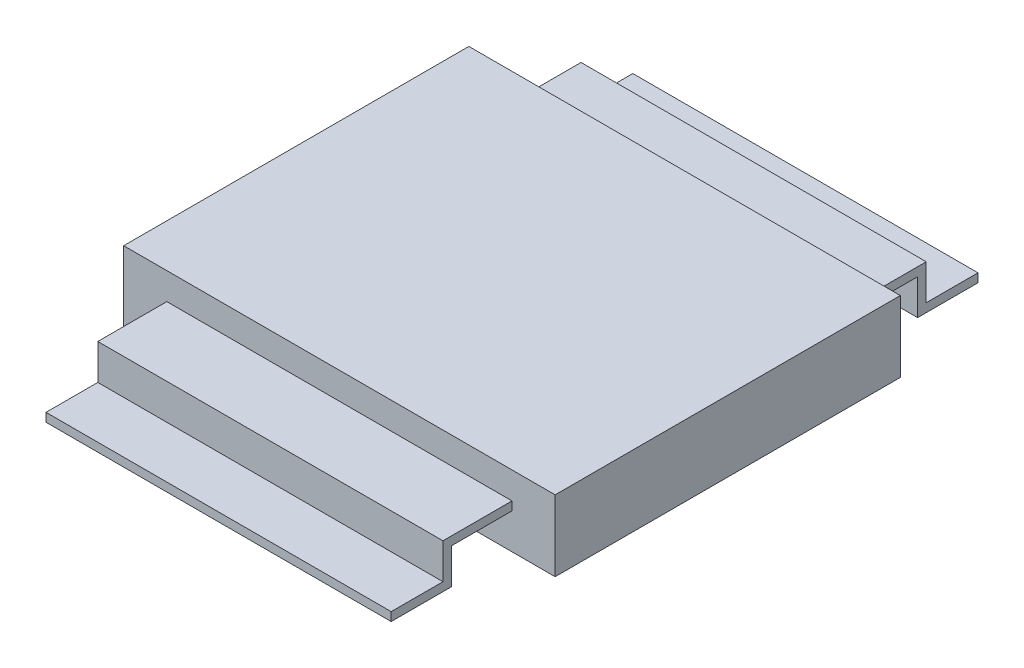
ISO-10303-21;
HEADER;
FILE_DESCRIPTION(('STEP AP214'),'2;1');
FILE_NAME('part.step','',(''),(''),'','','');
FILE_SCHEMA(('AUTOMOTIVE_DESIGN { 1 0 10303 214 1 1 1 1 }'));
ENDSEC;
DATA;
#1=APPLICATION_CONTEXT('core data for automotive mechanical design processes');
#2=APPLICATION_PROTOCOL_DEFINITION('international standard','automotive_design',2000,#1);
#3=PRODUCT_CONTEXT('',#1,'mechanical');
#4=PRODUCT('Part','Part','',(#3));
#5=PRODUCT_RELATED_PRODUCT_CATEGORY('part','',(#4));
#6=PRODUCT_DEFINITION_FORMATION('','',#4);
#7=PRODUCT_DEFINITION_CONTEXT('part definition',#1,'design');
#8=PRODUCT_DEFINITION('design','',#6,#7);
#9=PRODUCT_DEFINITION_SHAPE('','',#8);
#10=(LENGTH_UNIT() NAMED_UNIT(*) SI_UNIT(.MILLI.,.METRE.));
#11=(NAMED_UNIT(*) PLANE_ANGLE_UNIT() SI_UNIT($,.RADIAN.));
#12=(NAMED_UNIT(*) SI_UNIT($,.STERADIAN.) SOLID_ANGLE_UNIT());
#13=UNCERTAINTY_MEASURE_WITH_UNIT(LENGTH_MEASURE(1.E-05),#10,'distance_accuracy_value','');
#14=(GEOMETRIC_REPRESENTATION_CONTEXT(3) GLOBAL_UNCERTAINTY_ASSIGNED_CONTEXT((#13)) GLOBAL_UNIT_ASSIGNED_CONTEXT((#10,
#11,#12)) REPRESENTATION_CONTEXT('',''));
#15=CARTESIAN_POINT('',(0.,0.,0.));
#16=DIRECTION('',(0.,0.,1.));
#17=DIRECTION('',(1.,0.,0.));
#18=AXIS2_PLACEMENT_3D('',#15,#16,#17);
#19=CARTESIAN_POINT('',(3.175,1.044000004,2.54));
#20=DIRECTION('',(0.,0.,-1.));
#21=DIRECTION('',(0.,1.,0.));
#22=AXIS2_PLACEMENT_3D('',#19,#20,#21);
#23=PLANE('',#22);
#24=DIRECTION('',(-1.,0.,0.));
#25=VECTOR('',#24,1.);
#26=CARTESIAN_POINT('',(2.54,0.649000002000003,2.54));
#27=LINE('',#26,#25);
#28=CARTESIAN_POINT('',(2.54,0.649000002000003,2.54));
#29=VERTEX_POINT('',#28);
#30=CARTESIAN_POINT('',(-2.54,0.649000002000003,2.54));
#31=VERTEX_POINT('',#30);
#32=EDGE_CURVE('E284',#29,#31,#27,.T.);
#33=ORIENTED_EDGE('',*,*,#32,.F.);
#34=DIRECTION('',(0.,-1.,0.));
#35=VECTOR('',#34,1.);
#36=CARTESIAN_POINT('',(2.54,0.649000002000003,2.54));
#37=LINE('',#36,#35);
#38=CARTESIAN_POINT('',(2.54,0.522000002000003,2.54));
#39=VERTEX_POINT('',#38);
#40=EDGE_CURVE('E252',#29,#39,#37,.T.);
#41=ORIENTED_EDGE('',*,*,#40,.T.);
#42=DIRECTION('',(-1.,0.,0.));
#43=VECTOR('',#42,1.);
#44=CARTESIAN_POINT('',(2.54,0.522000002000003,2.54));
#45=LINE('',#44,#43);
#46=CARTESIAN_POINT('',(-2.54,0.522000002000003,2.54));
#47=VERTEX_POINT('',#46);
#48=EDGE_CURVE('E287',#39,#47,#45,.T.);
#49=ORIENTED_EDGE('',*,*,#48,.T.);
#50=DIRECTION('',(0.,-1.,0.));
#51=VECTOR('',#50,1.);
#52=CARTESIAN_POINT('',(-2.54,0.649000002000003,2.54));
#53=LINE('',#52,#51);
#54=EDGE_CURVE('E273',#31,#47,#53,.T.);
#55=ORIENTED_EDGE('',*,*,#54,.F.);
#56=EDGE_LOOP('',(#33,#41,#49,#55));
#57=FACE_BOUND('',#56,.T.);
#58=DIRECTION('',(0.,-1.,0.));
#59=VECTOR('',#58,1.);
#60=CARTESIAN_POINT('',(-3.175,1.044000004,2.54));
#61=LINE('',#60,#59);
#62=CARTESIAN_POINT('',(-3.175,1.044000004,2.54));
#63=VERTEX_POINT('',#62);
#64=CARTESIAN_POINT('',(-3.175,0.,2.54));
#65=VERTEX_POINT('',#64);
#66=EDGE_CURVE('E297',#63,#65,#61,.T.);
#67=ORIENTED_EDGE('',*,*,#66,.T.);
#68=DIRECTION('',(-1.,0.,0.));
#69=VECTOR('',#68,1.);
#70=CARTESIAN_POINT('',(3.175,0.,2.54));
#71=LINE('',#70,#69);
#72=CARTESIAN_POINT('',(3.175,0.,2.54));
#73=VERTEX_POINT('',#72);
#74=EDGE_CURVE('E11',#73,#65,#71,.T.);
#75=ORIENTED_EDGE('',*,*,#74,.F.);
#76=DIRECTION('',(0.,-1.,0.));
#77=VECTOR('',#76,1.);
#78=CARTESIAN_POINT('',(3.175,1.044000004,2.54));
#79=LINE('',#78,#77);
#80=CARTESIAN_POINT('',(3.175,1.044000004,2.54));
#81=VERTEX_POINT('',#80);
#82=EDGE_CURVE('E298',#81,#73,#79,.T.);
#83=ORIENTED_EDGE('',*,*,#82,.F.);
#84=DIRECTION('',(-1.,0.,0.));
#85=VECTOR('',#84,1.);
#86=CARTESIAN_POINT('',(3.175,1.044000004,2.54));
#87=LINE('',#86,#85);
#88=EDGE_CURVE('E308',#81,#63,#87,.T.);
#89=ORIENTED_EDGE('',*,*,#88,.T.);
#90=EDGE_LOOP('',(#67,#75,#83,#89));
#91=FACE_BOUND('',#90,.T.);
#92=ADVANCED_FACE('F35',(#57,#91),#23,.F.);
#93=CARTESIAN_POINT('',(3.175,0.,2.54));
#94=DIRECTION('',(0.,1.,0.));
#95=DIRECTION('',(0.,0.,1.));
#96=AXIS2_PLACEMENT_3D('',#93,#94,#95);
#97=PLANE('',#96);
#98=DIRECTION('',(0.,0.,-1.));
#99=VECTOR('',#98,1.);
#100=CARTESIAN_POINT('',(-3.175,0.,2.54));
#101=LINE('',#100,#99);
#102=CARTESIAN_POINT('',(-3.175,0.,-2.54));
#103=VERTEX_POINT('',#102);
#104=EDGE_CURVE('E311',#65,#103,#101,.T.);
#105=ORIENTED_EDGE('',*,*,#104,.T.);
#106=DIRECTION('',(-1.,0.,0.));
#107=VECTOR('',#106,1.);
#108=CARTESIAN_POINT('',(3.175,0.,-2.54));
#109=LINE('',#108,#107);
#110=CARTESIAN_POINT('',(3.175,0.,-2.54));
#111=VERTEX_POINT('',#110);
#112=EDGE_CURVE('E42',#111,#103,#109,.T.);
#113=ORIENTED_EDGE('',*,*,#112,.F.);
#114=DIRECTION('',(0.,0.,-1.));
#115=VECTOR('',#114,1.);
#116=CARTESIAN_POINT('',(3.175,0.,2.54));
#117=LINE('',#116,#115);
#118=EDGE_CURVE('E301',#73,#111,#117,.T.);
#119=ORIENTED_EDGE('',*,*,#118,.F.);
#120=ORIENTED_EDGE('',*,*,#74,.T.);
#121=EDGE_LOOP('',(#105,#113,#119,#120));
#122=FACE_BOUND('',#121,.T.);
#123=ADVANCED_FACE('F341',(#122),#97,.F.);
#124=CARTESIAN_POINT('',(3.175,1.044000004,-2.54));
#125=DIRECTION('',(0.,0.,1.));
#126=DIRECTION('',(0.,-1.,0.));
#127=AXIS2_PLACEMENT_3D('',#124,#125,#126);
#128=PLANE('',#127);
#129=DIRECTION('',(-1.,0.,0.));
#130=VECTOR('',#129,1.);
#131=CARTESIAN_POINT('',(2.54,0.522000002000003,-2.54));
#132=LINE('',#131,#130);
#133=CARTESIAN_POINT('',(2.54,0.522000002000003,-2.54));
#134=VERTEX_POINT('',#133);
#135=CARTESIAN_POINT('',(-2.54,0.522000002000003,-2.54));
#136=VERTEX_POINT('',#135);
#137=EDGE_CURVE('E54',#134,#136,#132,.T.);
#138=ORIENTED_EDGE('',*,*,#137,.F.);
#139=DIRECTION('',(0.,-1.,0.));
#140=VECTOR('',#139,1.);
#141=CARTESIAN_POINT('',(2.54,0.649000002000003,-2.54));
#142=LINE('',#141,#140);
#143=CARTESIAN_POINT('',(2.54,0.649000002000003,-2.54));
#144=VERTEX_POINT('',#143);
#145=EDGE_CURVE('E49',#144,#134,#142,.T.);
#146=ORIENTED_EDGE('',*,*,#145,.F.);
#147=DIRECTION('',(-1.,0.,0.));
#148=VECTOR('',#147,1.);
#149=CARTESIAN_POINT('',(2.54,0.649000002000003,-2.54));
#150=LINE('',#149,#148);
#151=CARTESIAN_POINT('',(-2.54,0.649000002000003,-2.54));
#152=VERTEX_POINT('',#151);
#153=EDGE_CURVE('E234',#144,#152,#150,.T.);
#154=ORIENTED_EDGE('',*,*,#153,.T.);
#155=DIRECTION('',(0.,-1.,0.));
#156=VECTOR('',#155,1.);
#157=CARTESIAN_POINT('',(-2.54,0.649000002000003,-2.54));
#158=LINE('',#157,#156);
#159=EDGE_CURVE('E213',#152,#136,#158,.T.);
#160=ORIENTED_EDGE('',*,*,#159,.T.);
#161=EDGE_LOOP('',(#138,#146,#154,#160));
#162=FACE_BOUND('',#161,.T.);
#163=DIRECTION('',(0.,1.,0.));
#164=VECTOR('',#163,1.);
#165=CARTESIAN_POINT('',(-3.175,1.044000004,-2.54));
#166=LINE('',#165,#164);
#167=CARTESIAN_POINT('',(-3.175,1.044000004,-2.54));
#168=VERTEX_POINT('',#167);
#169=EDGE_CURVE('E313',#103,#168,#166,.T.);
#170=ORIENTED_EDGE('',*,*,#169,.T.);
#171=DIRECTION('',(-1.,0.,0.));
#172=VECTOR('',#171,1.);
#173=CARTESIAN_POINT('',(3.175,1.044000004,-2.54));
#174=LINE('',#173,#172);
#175=CARTESIAN_POINT('',(3.175,1.044000004,-2.54));
#176=VERTEX_POINT('',#175);
#177=EDGE_CURVE('E318',#176,#168,#174,.T.);
#178=ORIENTED_EDGE('',*,*,#177,.F.);
#179=DIRECTION('',(0.,1.,0.));
#180=VECTOR('',#179,1.);
#181=CARTESIAN_POINT('',(3.175,1.044000004,-2.54));
#182=LINE('',#181,#180);
#183=EDGE_CURVE('E304',#111,#176,#182,.T.);
#184=ORIENTED_EDGE('',*,*,#183,.F.);
#185=ORIENTED_EDGE('',*,*,#112,.T.);
#186=EDGE_LOOP('',(#170,#178,#184,#185));
#187=FACE_BOUND('',#186,.T.);
#188=ADVANCED_FACE('F325',(#162,#187),#128,.F.);
#189=CARTESIAN_POINT('',(3.175,1.044000004,2.54));
#190=DIRECTION('',(0.,-1.,0.));
#191=DIRECTION('',(0.,0.,-1.));
#192=AXIS2_PLACEMENT_3D('',#189,#190,#191);
#193=PLANE('',#192);
#194=DIRECTION('',(0.,0.,1.));
#195=VECTOR('',#194,1.);
#196=CARTESIAN_POINT('',(-3.175,1.044000004,2.54));
#197=LINE('',#196,#195);
#198=EDGE_CURVE('E302',#168,#63,#197,.T.);
#199=ORIENTED_EDGE('',*,*,#198,.T.);
#200=ORIENTED_EDGE('',*,*,#88,.F.);
#201=DIRECTION('',(0.,0.,1.));
#202=VECTOR('',#201,1.);
#203=CARTESIAN_POINT('',(3.175,1.044000004,2.54));
#204=LINE('',#203,#202);
#205=EDGE_CURVE('E306',#176,#81,#204,.T.);
#206=ORIENTED_EDGE('',*,*,#205,.F.);
#207=ORIENTED_EDGE('',*,*,#177,.T.);
#208=EDGE_LOOP('',(#199,#200,#206,#207));
#209=FACE_BOUND('',#208,.T.);
#210=ADVANCED_FACE('F334',(#209),#193,.F.);
#211=CARTESIAN_POINT('',(3.175,0.,0.));
#212=DIRECTION('',(1.,0.,0.));
#213=DIRECTION('',(0.,0.,-1.));
#214=AXIS2_PLACEMENT_3D('',#211,#212,#213);
#215=PLANE('',#214);
#216=ORIENTED_EDGE('',*,*,#82,.T.);
#217=ORIENTED_EDGE('',*,*,#118,.T.);
#218=ORIENTED_EDGE('',*,*,#183,.T.);
#219=ORIENTED_EDGE('',*,*,#205,.T.);
#220=EDGE_LOOP('',(#216,#217,#218,#219));
#221=FACE_BOUND('',#220,.T.);
#222=ADVANCED_FACE('F340',(#221),#215,.T.);
#223=CARTESIAN_POINT('',(-3.175,0.,0.));
#224=DIRECTION('',(1.,0.,0.));
#225=DIRECTION('',(0.,0.,-1.));
#226=AXIS2_PLACEMENT_3D('',#223,#224,#225);
#227=PLANE('',#226);
#228=ORIENTED_EDGE('',*,*,#66,.F.);
#229=ORIENTED_EDGE('',*,*,#198,.F.);
#230=ORIENTED_EDGE('',*,*,#169,.F.);
#231=ORIENTED_EDGE('',*,*,#104,.F.);
#232=EDGE_LOOP('',(#228,#229,#230,#231));
#233=FACE_BOUND('',#232,.T.);
#234=ADVANCED_FACE('F331',(#233),#227,.F.);
#235=CARTESIAN_POINT('',(2.54,0.127,3.429));
#236=DIRECTION('',(0.,-1.,0.));
#237=DIRECTION('',(0.,0.,-1.));
#238=AXIS2_PLACEMENT_3D('',#235,#236,#237);
#239=PLANE('',#238);
#240=DIRECTION('',(0.,0.,-1.));
#241=VECTOR('',#240,1.);
#242=CARTESIAN_POINT('',(-2.54,0.127,3.429));
#243=LINE('',#242,#241);
#244=CARTESIAN_POINT('',(-2.54,0.127,3.556));
#245=VERTEX_POINT('',#244);
#246=CARTESIAN_POINT('',(-2.54,0.127,4.318));
#247=VERTEX_POINT('',#246);
#248=EDGE_CURVE('E179',#245,#247,#243,.F.);
#249=ORIENTED_EDGE('',*,*,#248,.T.);
#250=DIRECTION('',(-1.,0.,0.));
#251=VECTOR('',#250,1.);
#252=CARTESIAN_POINT('',(2.54,0.127,4.318));
#253=LINE('',#252,#251);
#254=CARTESIAN_POINT('',(2.54,0.127,4.318));
#255=VERTEX_POINT('',#254);
#256=EDGE_CURVE('E295',#255,#247,#253,.T.);
#257=ORIENTED_EDGE('',*,*,#256,.F.);
#258=DIRECTION('',(0.,0.,-1.));
#259=VECTOR('',#258,1.);
#260=CARTESIAN_POINT('',(2.54,0.127,3.429));
#261=LINE('',#260,#259);
#262=CARTESIAN_POINT('',(2.54,0.127,3.556));
#263=VERTEX_POINT('',#262);
#264=EDGE_CURVE('E237',#263,#255,#261,.F.);
#265=ORIENTED_EDGE('',*,*,#264,.F.);
#266=DIRECTION('',(-1.,0.,0.));
#267=VECTOR('',#266,1.);
#268=CARTESIAN_POINT('',(2.54,0.127,3.556));
#269=LINE('',#268,#267);
#270=EDGE_CURVE('E258',#263,#245,#269,.T.);
#271=ORIENTED_EDGE('',*,*,#270,.T.);
#272=EDGE_LOOP('',(#249,#257,#265,#271));
#273=FACE_BOUND('',#272,.T.);
#274=ADVANCED_FACE('F354',(#273),#239,.F.);
#275=CARTESIAN_POINT('',(2.54,0.,4.318));
#276=DIRECTION('',(0.,0.,1.));
#277=DIRECTION('',(1.,0.,0.));
#278=AXIS2_PLACEMENT_3D('',#275,#276,#277);
#279=PLANE('',#278);
#280=DIRECTION('',(0.,1.,0.));
#281=VECTOR('',#280,1.);
#282=CARTESIAN_POINT('',(-2.54,0.,4.318));
#283=LINE('',#282,#281);
#284=CARTESIAN_POINT('',(-2.54,0.,4.318));
#285=VERTEX_POINT('',#284);
#286=EDGE_CURVE('E261',#285,#247,#283,.T.);
#287=ORIENTED_EDGE('',*,*,#286,.F.);
#288=DIRECTION('',(-1.,0.,0.));
#289=VECTOR('',#288,1.);
#290=CARTESIAN_POINT('',(2.54,0.,4.318));
#291=LINE('',#290,#289);
#292=CARTESIAN_POINT('',(2.54,0.,4.318));
#293=VERTEX_POINT('',#292);
#294=EDGE_CURVE('E293',#293,#285,#291,.T.);
#295=ORIENTED_EDGE('',*,*,#294,.F.);
#296=DIRECTION('',(0.,1.,0.));
#297=VECTOR('',#296,1.);
#298=CARTESIAN_POINT('',(2.54,0.,4.318));
#299=LINE('',#298,#297);
#300=EDGE_CURVE('E239',#293,#255,#299,.T.);
#301=ORIENTED_EDGE('',*,*,#300,.T.);
#302=ORIENTED_EDGE('',*,*,#256,.T.);
#303=EDGE_LOOP('',(#287,#295,#301,#302));
#304=FACE_BOUND('',#303,.T.);
#305=ADVANCED_FACE('F359',(#304),#279,.T.);
#306=CARTESIAN_POINT('',(2.54,0.,3.429));
#307=DIRECTION('',(0.,-1.,0.));
#308=DIRECTION('',(0.,0.,-1.));
#309=AXIS2_PLACEMENT_3D('',#306,#307,#308);
#310=PLANE('',#309);
#311=DIRECTION('',(0.,0.,1.));
#312=VECTOR('',#311,1.);
#313=CARTESIAN_POINT('',(-2.54,0.,3.429));
#314=LINE('',#313,#312);
#315=CARTESIAN_POINT('',(-2.54,0.,3.429));
#316=VERTEX_POINT('',#315);
#317=EDGE_CURVE('E264',#316,#285,#314,.T.);
#318=ORIENTED_EDGE('',*,*,#317,.F.);
#319=DIRECTION('',(-1.,0.,0.));
#320=VECTOR('',#319,1.);
#321=CARTESIAN_POINT('',(2.54,0.,3.429));
#322=LINE('',#321,#320);
#323=CARTESIAN_POINT('',(2.54,0.,3.429));
#324=VERTEX_POINT('',#323);
#325=EDGE_CURVE('E291',#324,#316,#322,.T.);
#326=ORIENTED_EDGE('',*,*,#325,.F.);
#327=DIRECTION('',(0.,0.,1.));
#328=VECTOR('',#327,1.);
#329=CARTESIAN_POINT('',(2.54,0.,3.429));
#330=LINE('',#329,#328);
#331=EDGE_CURVE('E243',#324,#293,#330,.T.);
#332=ORIENTED_EDGE('',*,*,#331,.T.);
#333=ORIENTED_EDGE('',*,*,#294,.T.);
#334=EDGE_LOOP('',(#318,#326,#332,#333));
#335=FACE_BOUND('',#334,.T.);
#336=ADVANCED_FACE('F363',(#335),#310,.T.);
#337=CARTESIAN_POINT('',(2.54,0.522000002000003,3.429));
#338=DIRECTION('',(0.,0.,-1.));
#339=DIRECTION('',(-1.,0.,0.));
#340=AXIS2_PLACEMENT_3D('',#337,#338,#339);
#341=PLANE('',#340);
#342=DIRECTION('',(0.,-1.,0.));
#343=VECTOR('',#342,1.);
#344=CARTESIAN_POINT('',(-2.54,0.522000002000003,3.429));
#345=LINE('',#344,#343);
#346=CARTESIAN_POINT('',(-2.54,0.522000002000003,3.429));
#347=VERTEX_POINT('',#346);
#348=EDGE_CURVE('E267',#347,#316,#345,.T.);
#349=ORIENTED_EDGE('',*,*,#348,.F.);
#350=DIRECTION('',(-1.,0.,0.));
#351=VECTOR('',#350,1.);
#352=CARTESIAN_POINT('',(2.54,0.522000002000003,3.429));
#353=LINE('',#352,#351);
#354=CARTESIAN_POINT('',(2.54,0.522000002000003,3.429));
#355=VERTEX_POINT('',#354);
#356=EDGE_CURVE('E289',#355,#347,#353,.T.);
#357=ORIENTED_EDGE('',*,*,#356,.F.);
#358=DIRECTION('',(0.,-1.,0.));
#359=VECTOR('',#358,1.);
#360=CARTESIAN_POINT('',(2.54,0.522000002000003,3.429));
#361=LINE('',#360,#359);
#362=EDGE_CURVE('E246',#355,#324,#361,.T.);
#363=ORIENTED_EDGE('',*,*,#362,.T.);
#364=ORIENTED_EDGE('',*,*,#325,.T.);
#365=EDGE_LOOP('',(#349,#357,#363,#364));
#366=FACE_BOUND('',#365,.T.);
#367=ADVANCED_FACE('F367',(#366),#341,.T.);
#368=CARTESIAN_POINT('',(2.54,0.522000002000003,2.54));
#369=DIRECTION('',(0.,-1.,0.));
#370=DIRECTION('',(0.,0.,-1.));
#371=AXIS2_PLACEMENT_3D('',#368,#369,#370);
#372=PLANE('',#371);
#373=DIRECTION('',(0.,0.,1.));
#374=VECTOR('',#373,1.);
#375=CARTESIAN_POINT('',(-2.54,0.522000002000003,2.54));
#376=LINE('',#375,#374);
#377=EDGE_CURVE('E270',#47,#347,#376,.T.);
#378=ORIENTED_EDGE('',*,*,#377,.F.);
#379=ORIENTED_EDGE('',*,*,#48,.F.);
#380=DIRECTION('',(0.,0.,1.));
#381=VECTOR('',#380,1.);
#382=CARTESIAN_POINT('',(2.54,0.522000002000003,2.54));
#383=LINE('',#382,#381);
#384=EDGE_CURVE('E249',#39,#355,#383,.T.);
#385=ORIENTED_EDGE('',*,*,#384,.T.);
#386=ORIENTED_EDGE('',*,*,#356,.T.);
#387=EDGE_LOOP('',(#378,#379,#385,#386));
#388=FACE_BOUND('',#387,.T.);
#389=ADVANCED_FACE('F371',(#388),#372,.T.);
#390=CARTESIAN_POINT('',(2.54,0.649000002000003,2.54));
#391=DIRECTION('',(0.,-1.,0.));
#392=DIRECTION('',(0.,0.,-1.));
#393=AXIS2_PLACEMENT_3D('',#390,#391,#392);
#394=PLANE('',#393);
#395=DIRECTION('',(0.,0.,-1.));
#396=VECTOR('',#395,1.);
#397=CARTESIAN_POINT('',(-2.54,0.649000002000003,2.54));
#398=LINE('',#397,#396);
#399=CARTESIAN_POINT('',(-2.54,0.649000002000003,3.556));
#400=VERTEX_POINT('',#399);
#401=EDGE_CURVE('E276',#31,#400,#398,.F.);
#402=ORIENTED_EDGE('',*,*,#401,.T.);
#403=DIRECTION('',(-1.,0.,0.));
#404=VECTOR('',#403,1.);
#405=CARTESIAN_POINT('',(2.54,0.649000002000003,3.556));
#406=LINE('',#405,#404);
#407=CARTESIAN_POINT('',(2.54,0.649000002000003,3.556));
#408=VERTEX_POINT('',#407);
#409=EDGE_CURVE('E281',#408,#400,#406,.T.);
#410=ORIENTED_EDGE('',*,*,#409,.F.);
#411=DIRECTION('',(0.,0.,-1.));
#412=VECTOR('',#411,1.);
#413=CARTESIAN_POINT('',(2.54,0.649000002000003,2.54));
#414=LINE('',#413,#412);
#415=EDGE_CURVE('E254',#29,#408,#414,.F.);
#416=ORIENTED_EDGE('',*,*,#415,.F.);
#417=ORIENTED_EDGE('',*,*,#32,.T.);
#418=EDGE_LOOP('',(#402,#410,#416,#417));
#419=FACE_BOUND('',#418,.T.);
#420=ADVANCED_FACE('F375',(#419),#394,.F.);
#421=CARTESIAN_POINT('',(2.54,0.522000002000003,3.556));
#422=DIRECTION('',(0.,0.,-1.));
#423=DIRECTION('',(-1.,0.,0.));
#424=AXIS2_PLACEMENT_3D('',#421,#422,#423);
#425=PLANE('',#424);
#426=DIRECTION('',(0.,1.,0.));
#427=VECTOR('',#426,1.);
#428=CARTESIAN_POINT('',(-2.54,0.522000002000003,3.556));
#429=LINE('',#428,#427);
#430=EDGE_CURVE('E240',#400,#245,#429,.F.);
#431=ORIENTED_EDGE('',*,*,#430,.T.);
#432=ORIENTED_EDGE('',*,*,#270,.F.);
#433=DIRECTION('',(0.,1.,0.));
#434=VECTOR('',#433,1.);
#435=CARTESIAN_POINT('',(2.54,0.522000002000003,3.556));
#436=LINE('',#435,#434);
#437=EDGE_CURVE('E256',#408,#263,#436,.F.);
#438=ORIENTED_EDGE('',*,*,#437,.F.);
#439=ORIENTED_EDGE('',*,*,#409,.T.);
#440=EDGE_LOOP('',(#431,#432,#438,#439));
#441=FACE_BOUND('',#440,.T.);
#442=ADVANCED_FACE('F379',(#441),#425,.F.);
#443=CARTESIAN_POINT('',(2.54,0.,0.));
#444=DIRECTION('',(1.,0.,0.));
#445=DIRECTION('',(0.,0.,-1.));
#446=AXIS2_PLACEMENT_3D('',#443,#444,#445);
#447=PLANE('',#446);
#448=ORIENTED_EDGE('',*,*,#264,.T.);
#449=ORIENTED_EDGE('',*,*,#300,.F.);
#450=ORIENTED_EDGE('',*,*,#331,.F.);
#451=ORIENTED_EDGE('',*,*,#362,.F.);
#452=ORIENTED_EDGE('',*,*,#384,.F.);
#453=ORIENTED_EDGE('',*,*,#40,.F.);
#454=ORIENTED_EDGE('',*,*,#415,.T.);
#455=ORIENTED_EDGE('',*,*,#437,.T.);
#456=EDGE_LOOP('',(#448,#449,#450,#451,#452,#453,#454,#455));
#457=FACE_BOUND('',#456,.T.);
#458=ADVANCED_FACE('F383',(#457),#447,.T.);
#459=CARTESIAN_POINT('',(-2.54,0.,0.));
#460=DIRECTION('',(1.,0.,0.));
#461=DIRECTION('',(0.,0.,-1.));
#462=AXIS2_PLACEMENT_3D('',#459,#460,#461);
#463=PLANE('',#462);
#464=ORIENTED_EDGE('',*,*,#248,.F.);
#465=ORIENTED_EDGE('',*,*,#430,.F.);
#466=ORIENTED_EDGE('',*,*,#401,.F.);
#467=ORIENTED_EDGE('',*,*,#54,.T.);
#468=ORIENTED_EDGE('',*,*,#377,.T.);
#469=ORIENTED_EDGE('',*,*,#348,.T.);
#470=ORIENTED_EDGE('',*,*,#317,.T.);
#471=ORIENTED_EDGE('',*,*,#286,.T.);
#472=EDGE_LOOP('',(#464,#465,#466,#467,#468,#469,#470,#471));
#473=FACE_BOUND('',#472,.T.);
#474=ADVANCED_FACE('F385',(#473),#463,.F.);
#475=CARTESIAN_POINT('',(2.54,0.127,-3.429));
#476=DIRECTION('',(0.,1.,0.));
#477=DIRECTION('',(0.,0.,1.));
#478=AXIS2_PLACEMENT_3D('',#475,#476,#477);
#479=PLANE('',#478);
#480=DIRECTION('',(0.,0.,1.));
#481=VECTOR('',#480,1.);
#482=CARTESIAN_POINT('',(-2.54,0.127,-3.429));
#483=LINE('',#482,#481);
#484=CARTESIAN_POINT('',(-2.54,0.127,-3.556));
#485=VERTEX_POINT('',#484);
#486=CARTESIAN_POINT('',(-2.54,0.127,-4.318));
#487=VERTEX_POINT('',#486);
#488=EDGE_CURVE('E174',#485,#487,#483,.F.);
#489=ORIENTED_EDGE('',*,*,#488,.F.);
#490=DIRECTION('',(-1.,0.,0.));
#491=VECTOR('',#490,1.);
#492=CARTESIAN_POINT('',(2.54,0.127,-3.556));
#493=LINE('',#492,#491);
#494=CARTESIAN_POINT('',(2.54,0.127,-3.556));
#495=VERTEX_POINT('',#494);
#496=EDGE_CURVE('E169',#495,#485,#493,.T.);
#497=ORIENTED_EDGE('',*,*,#496,.F.);
#498=DIRECTION('',(0.,0.,1.));
#499=VECTOR('',#498,1.);
#500=CARTESIAN_POINT('',(2.54,0.127,-3.429));
#501=LINE('',#500,#499);
#502=CARTESIAN_POINT('',(2.54,0.127,-4.318));
#503=VERTEX_POINT('',#502);
#504=EDGE_CURVE('E172',#495,#503,#501,.F.);
#505=ORIENTED_EDGE('',*,*,#504,.T.);
#506=DIRECTION('',(-1.,0.,0.));
#507=VECTOR('',#506,1.);
#508=CARTESIAN_POINT('',(2.54,0.127,-4.318));
#509=LINE('',#508,#507);
#510=EDGE_CURVE('E206',#503,#487,#509,.T.);
#511=ORIENTED_EDGE('',*,*,#510,.T.);
#512=EDGE_LOOP('',(#489,#497,#505,#511));
#513=FACE_BOUND('',#512,.T.);
#514=ADVANCED_FACE('F171',(#513),#479,.T.);
#515=CARTESIAN_POINT('',(2.54,0.522000002000003,-3.556));
#516=DIRECTION('',(0.,0.,-1.));
#517=DIRECTION('',(-1.,0.,0.));
#518=AXIS2_PLACEMENT_3D('',#515,#516,#517);
#519=PLANE('',#518);
#520=DIRECTION('',(0.,1.,0.));
#521=VECTOR('',#520,1.);
#522=CARTESIAN_POINT('',(-2.54,0.522000002000003,-3.556));
#523=LINE('',#522,#521);
#524=CARTESIAN_POINT('',(-2.54,0.649000002000003,-3.556));
#525=VERTEX_POINT('',#524);
#526=EDGE_CURVE('E208',#525,#485,#523,.F.);
#527=ORIENTED_EDGE('',*,*,#526,.F.);
#528=DIRECTION('',(-1.,0.,0.));
#529=VECTOR('',#528,1.);
#530=CARTESIAN_POINT('',(2.54,0.649000002000003,-3.556));
#531=LINE('',#530,#529);
#532=CARTESIAN_POINT('',(2.54,0.649000002000003,-3.556));
#533=VERTEX_POINT('',#532);
#534=EDGE_CURVE('E180',#533,#525,#531,.T.);
#535=ORIENTED_EDGE('',*,*,#534,.F.);
#536=DIRECTION('',(0.,1.,0.));
#537=VECTOR('',#536,1.);
#538=CARTESIAN_POINT('',(2.54,0.522000002000003,-3.556));
#539=LINE('',#538,#537);
#540=EDGE_CURVE('E186',#533,#495,#539,.F.);
#541=ORIENTED_EDGE('',*,*,#540,.T.);
#542=ORIENTED_EDGE('',*,*,#496,.T.);
#543=EDGE_LOOP('',(#527,#535,#541,#542));
#544=FACE_BOUND('',#543,.T.);
#545=ADVANCED_FACE('F193',(#544),#519,.T.);
#546=CARTESIAN_POINT('',(2.54,0.649000002000003,-2.54));
#547=DIRECTION('',(0.,1.,0.));
#548=DIRECTION('',(0.,0.,1.));
#549=AXIS2_PLACEMENT_3D('',#546,#547,#548);
#550=PLANE('',#549);
#551=DIRECTION('',(0.,0.,1.));
#552=VECTOR('',#551,1.);
#553=CARTESIAN_POINT('',(-2.54,0.649000002000003,-2.54));
#554=LINE('',#553,#552);
#555=EDGE_CURVE('E210',#152,#525,#554,.F.);
#556=ORIENTED_EDGE('',*,*,#555,.F.);
#557=ORIENTED_EDGE('',*,*,#153,.F.);
#558=DIRECTION('',(0.,0.,1.));
#559=VECTOR('',#558,1.);
#560=CARTESIAN_POINT('',(2.54,0.649000002000003,-2.54));
#561=LINE('',#560,#559);
#562=EDGE_CURVE('E194',#144,#533,#561,.F.);
#563=ORIENTED_EDGE('',*,*,#562,.T.);
#564=ORIENTED_EDGE('',*,*,#534,.T.);
#565=EDGE_LOOP('',(#556,#557,#563,#564));
#566=FACE_BOUND('',#565,.T.);
#567=ADVANCED_FACE('F396',(#566),#550,.T.);
#568=CARTESIAN_POINT('',(2.54,0.522000002000003,-2.54));
#569=DIRECTION('',(0.,1.,0.));
#570=DIRECTION('',(0.,0.,1.));
#571=AXIS2_PLACEMENT_3D('',#568,#569,#570);
#572=PLANE('',#571);
#573=DIRECTION('',(0.,0.,-1.));
#574=VECTOR('',#573,1.);
#575=CARTESIAN_POINT('',(-2.54,0.522000002000003,-2.54));
#576=LINE('',#575,#574);
#577=CARTESIAN_POINT('',(-2.54,0.522000002000003,-3.429));
#578=VERTEX_POINT('',#577);
#579=EDGE_CURVE('E215',#136,#578,#576,.T.);
#580=ORIENTED_EDGE('',*,*,#579,.T.);
#581=DIRECTION('',(-1.,0.,0.));
#582=VECTOR('',#581,1.);
#583=CARTESIAN_POINT('',(2.54,0.522000002000003,-3.429));
#584=LINE('',#583,#582);
#585=CARTESIAN_POINT('',(2.54,0.522000002000003,-3.429));
#586=VERTEX_POINT('',#585);
#587=EDGE_CURVE('E230',#586,#578,#584,.T.);
#588=ORIENTED_EDGE('',*,*,#587,.F.);
#589=DIRECTION('',(0.,0.,-1.));
#590=VECTOR('',#589,1.);
#591=CARTESIAN_POINT('',(2.54,0.522000002000003,-2.54));
#592=LINE('',#591,#590);
#593=EDGE_CURVE('E199',#134,#586,#592,.T.);
#594=ORIENTED_EDGE('',*,*,#593,.F.);
#595=ORIENTED_EDGE('',*,*,#137,.T.);
#596=EDGE_LOOP('',(#580,#588,#594,#595));
#597=FACE_BOUND('',#596,.T.);
#598=ADVANCED_FACE('F399',(#597),#572,.F.);
#599=CARTESIAN_POINT('',(2.54,0.522000002000003,-3.429));
#600=DIRECTION('',(0.,0.,-1.));
#601=DIRECTION('',(-1.,0.,0.));
#602=AXIS2_PLACEMENT_3D('',#599,#600,#601);
#603=PLANE('',#602);
#604=DIRECTION('',(0.,-1.,0.));
#605=VECTOR('',#604,1.);
#606=CARTESIAN_POINT('',(-2.54,0.522000002000003,-3.429));
#607=LINE('',#606,#605);
#608=CARTESIAN_POINT('',(-2.54,0.,-3.429));
#609=VERTEX_POINT('',#608);
#610=EDGE_CURVE('E217',#578,#609,#607,.T.);
#611=ORIENTED_EDGE('',*,*,#610,.T.);
#612=DIRECTION('',(-1.,0.,0.));
#613=VECTOR('',#612,1.);
#614=CARTESIAN_POINT('',(2.54,0.,-3.429));
#615=LINE('',#614,#613);
#616=CARTESIAN_POINT('',(2.54,0.,-3.429));
#617=VERTEX_POINT('',#616);
#618=EDGE_CURVE('E227',#617,#609,#615,.T.);
#619=ORIENTED_EDGE('',*,*,#618,.F.);
#620=DIRECTION('',(0.,-1.,0.));
#621=VECTOR('',#620,1.);
#622=CARTESIAN_POINT('',(2.54,0.522000002000003,-3.429));
#623=LINE('',#622,#621);
#624=EDGE_CURVE('E201',#586,#617,#623,.T.);
#625=ORIENTED_EDGE('',*,*,#624,.F.);
#626=ORIENTED_EDGE('',*,*,#587,.T.);
#627=EDGE_LOOP('',(#611,#619,#625,#626));
#628=FACE_BOUND('',#627,.T.);
#629=ADVANCED_FACE('F403',(#628),#603,.F.);
#630=CARTESIAN_POINT('',(2.54,0.,-3.429));
#631=DIRECTION('',(0.,1.,0.));
#632=DIRECTION('',(0.,0.,1.));
#633=AXIS2_PLACEMENT_3D('',#630,#631,#632);
#634=PLANE('',#633);
#635=DIRECTION('',(0.,0.,-1.));
#636=VECTOR('',#635,1.);
#637=CARTESIAN_POINT('',(-2.54,0.,-3.429));
#638=LINE('',#637,#636);
#639=CARTESIAN_POINT('',(-2.54,0.,-4.318));
#640=VERTEX_POINT('',#639);
#641=EDGE_CURVE('E219',#609,#640,#638,.T.);
#642=ORIENTED_EDGE('',*,*,#641,.T.);
#643=DIRECTION('',(-1.,0.,0.));
#644=VECTOR('',#643,1.);
#645=CARTESIAN_POINT('',(2.54,0.,-4.318));
#646=LINE('',#645,#644);
#647=CARTESIAN_POINT('',(2.54,0.,-4.318));
#648=VERTEX_POINT('',#647);
#649=EDGE_CURVE('E224',#648,#640,#646,.T.);
#650=ORIENTED_EDGE('',*,*,#649,.F.);
#651=DIRECTION('',(0.,0.,-1.));
#652=VECTOR('',#651,1.);
#653=CARTESIAN_POINT('',(2.54,0.,-3.429));
#654=LINE('',#653,#652);
#655=EDGE_CURVE('E203',#617,#648,#654,.T.);
#656=ORIENTED_EDGE('',*,*,#655,.F.);
#657=ORIENTED_EDGE('',*,*,#618,.T.);
#658=EDGE_LOOP('',(#642,#650,#656,#657));
#659=FACE_BOUND('',#658,.T.);
#660=ADVANCED_FACE('F407',(#659),#634,.F.);
#661=CARTESIAN_POINT('',(2.54,0.,-4.318));
#662=DIRECTION('',(0.,0.,1.));
#663=DIRECTION('',(1.,0.,0.));
#664=AXIS2_PLACEMENT_3D('',#661,#662,#663);
#665=PLANE('',#664);
#666=DIRECTION('',(0.,1.,0.));
#667=VECTOR('',#666,1.);
#668=CARTESIAN_POINT('',(-2.54,0.,-4.318));
#669=LINE('',#668,#667);
#670=EDGE_CURVE('E191',#640,#487,#669,.T.);
#671=ORIENTED_EDGE('',*,*,#670,.T.);
#672=ORIENTED_EDGE('',*,*,#510,.F.);
#673=DIRECTION('',(0.,1.,0.));
#674=VECTOR('',#673,1.);
#675=CARTESIAN_POINT('',(2.54,0.,-4.318));
#676=LINE('',#675,#674);
#677=EDGE_CURVE('E189',#648,#503,#676,.T.);
#678=ORIENTED_EDGE('',*,*,#677,.F.);
#679=ORIENTED_EDGE('',*,*,#649,.T.);
#680=EDGE_LOOP('',(#671,#672,#678,#679));
#681=FACE_BOUND('',#680,.T.);
#682=ADVANCED_FACE('F411',(#681),#665,.F.);
#683=CARTESIAN_POINT('',(2.54,0.,0.));
#684=DIRECTION('',(1.,0.,0.));
#685=DIRECTION('',(0.,0.,1.));
#686=AXIS2_PLACEMENT_3D('',#683,#684,#685);
#687=PLANE('',#686);
#688=ORIENTED_EDGE('',*,*,#504,.F.);
#689=ORIENTED_EDGE('',*,*,#540,.F.);
#690=ORIENTED_EDGE('',*,*,#562,.F.);
#691=ORIENTED_EDGE('',*,*,#145,.T.);
#692=ORIENTED_EDGE('',*,*,#593,.T.);
#693=ORIENTED_EDGE('',*,*,#624,.T.);
#694=ORIENTED_EDGE('',*,*,#655,.T.);
#695=ORIENTED_EDGE('',*,*,#677,.T.);
#696=EDGE_LOOP('',(#688,#689,#690,#691,#692,#693,#694,#695));
#697=FACE_BOUND('',#696,.T.);
#698=ADVANCED_FACE('F184',(#697),#687,.T.);
#699=CARTESIAN_POINT('',(-2.54,0.,0.));
#700=DIRECTION('',(1.,0.,0.));
#701=DIRECTION('',(0.,0.,1.));
#702=AXIS2_PLACEMENT_3D('',#699,#700,#701);
#703=PLANE('',#702);
#704=ORIENTED_EDGE('',*,*,#488,.T.);
#705=ORIENTED_EDGE('',*,*,#670,.F.);
#706=ORIENTED_EDGE('',*,*,#641,.F.);
#707=ORIENTED_EDGE('',*,*,#610,.F.);
#708=ORIENTED_EDGE('',*,*,#579,.F.);
#709=ORIENTED_EDGE('',*,*,#159,.F.);
#710=ORIENTED_EDGE('',*,*,#555,.T.);
#711=ORIENTED_EDGE('',*,*,#526,.T.);
#712=EDGE_LOOP('',(#704,#705,#706,#707,#708,#709,#710,#711));
#713=FACE_BOUND('',#712,.T.);
#714=ADVANCED_FACE('F416',(#713),#703,.F.);
#715=CLOSED_SHELL('',(#92,#123,#188,#210,#222,#234,#274,#305,#336,#367,#389,#420,#442,#458,#474,
#514,#545,#567,#598,#629,#660,#682,#698,#714));
#716=MANIFOLD_SOLID_BREP('B2',#715);
#717=ADVANCED_BREP_SHAPE_REPRESENTATION('',(#18,#716),#14);
#718=SHAPE_DEFINITION_REPRESENTATION(#9,#717);
ENDSEC;
END-ISO-10303-21;
